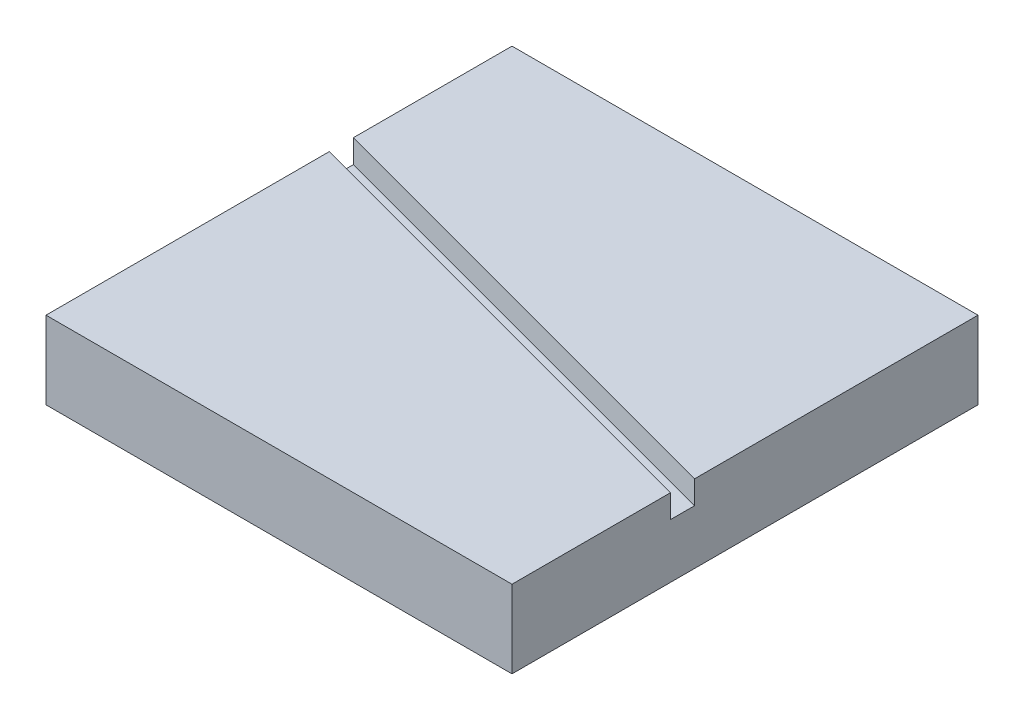
ISO-10303-21;
HEADER;
FILE_DESCRIPTION(('STEP AP214'),'2;1');
FILE_NAME('part.step','',(''),(''),'','','');
FILE_SCHEMA(('AUTOMOTIVE_DESIGN { 1 0 10303 214 1 1 1 1 }'));
ENDSEC;
DATA;
#1=APPLICATION_CONTEXT('core data for automotive mechanical design processes');
#2=APPLICATION_PROTOCOL_DEFINITION('international standard','automotive_design',2000,#1);
#3=PRODUCT_CONTEXT('',#1,'mechanical');
#4=PRODUCT('Part','Part','',(#3));
#5=PRODUCT_RELATED_PRODUCT_CATEGORY('part','',(#4));
#6=PRODUCT_DEFINITION_FORMATION('','',#4);
#7=PRODUCT_DEFINITION_CONTEXT('part definition',#1,'design');
#8=PRODUCT_DEFINITION('design','',#6,#7);
#9=PRODUCT_DEFINITION_SHAPE('','',#8);
#10=(LENGTH_UNIT() NAMED_UNIT(*) SI_UNIT(.MILLI.,.METRE.));
#11=(NAMED_UNIT(*) PLANE_ANGLE_UNIT() SI_UNIT($,.RADIAN.));
#12=(NAMED_UNIT(*) SI_UNIT($,.STERADIAN.) SOLID_ANGLE_UNIT());
#13=UNCERTAINTY_MEASURE_WITH_UNIT(LENGTH_MEASURE(1.E-05),#10,'distance_accuracy_value','');
#14=(GEOMETRIC_REPRESENTATION_CONTEXT(3) GLOBAL_UNCERTAINTY_ASSIGNED_CONTEXT((#13)) GLOBAL_UNIT_ASSIGNED_CONTEXT((#10,
#11,#12)) REPRESENTATION_CONTEXT('',''));
#15=CARTESIAN_POINT('',(0.,0.,0.));
#16=DIRECTION('',(0.,0.,1.));
#17=DIRECTION('',(1.,0.,0.));
#18=AXIS2_PLACEMENT_3D('',#15,#16,#17);
#19=CARTESIAN_POINT('',(0.,10.,0.));
#20=DIRECTION('',(0.,1.,0.));
#21=DIRECTION('',(0.,0.,1.));
#22=AXIS2_PLACEMENT_3D('',#19,#20,#21);
#23=PLANE('',#22);
#24=DIRECTION('',(-0.965925826289069,0.,-0.25881904510252));
#25=VECTOR('',#24,1.);
#26=CARTESIAN_POINT('',(0.388228567653783,10.,-1.44888873943361));
#27=LINE('',#26,#25);
#28=CARTESIAN_POINT('',(30.,10.,6.48556150231853));
#29=VERTEX_POINT('',#28);
#30=CARTESIAN_POINT('',(-30.,10.,-9.5913900435488));
#31=VERTEX_POINT('',#30);
#32=EDGE_CURVE('E41',#29,#31,#27,.T.);
#33=ORIENTED_EDGE('',*,*,#32,.F.);
#34=DIRECTION('',(0.,0.,-1.));
#35=VECTOR('',#34,1.);
#36=CARTESIAN_POINT('',(30.,10.,-30.));
#37=LINE('',#36,#35);
#38=CARTESIAN_POINT('',(30.,10.,-30.));
#39=VERTEX_POINT('',#38);
#40=EDGE_CURVE('E86',#29,#39,#37,.T.);
#41=ORIENTED_EDGE('',*,*,#40,.T.);
#42=DIRECTION('',(-1.,0.,0.));
#43=VECTOR('',#42,1.);
#44=CARTESIAN_POINT('',(-30.,10.,-30.));
#45=LINE('',#44,#43);
#46=CARTESIAN_POINT('',(-30.,10.,-30.));
#47=VERTEX_POINT('',#46);
#48=EDGE_CURVE('E124',#39,#47,#45,.T.);
#49=ORIENTED_EDGE('',*,*,#48,.T.);
#50=DIRECTION('',(0.,0.,1.));
#51=VECTOR('',#50,1.);
#52=CARTESIAN_POINT('',(-30.,10.,-30.));
#53=LINE('',#52,#51);
#54=EDGE_CURVE('E131',#47,#31,#53,.T.);
#55=ORIENTED_EDGE('',*,*,#54,.T.);
#56=EDGE_LOOP('',(#33,#41,#49,#55));
#57=FACE_BOUND('',#56,.T.);
#58=ADVANCED_FACE('F33',(#57),#23,.T.);
#59=CARTESIAN_POINT('',(30.,10.,-30.));
#60=DIRECTION('',(-1.,0.,0.));
#61=DIRECTION('',(0.,0.,1.));
#62=AXIS2_PLACEMENT_3D('',#59,#60,#61);
#63=PLANE('',#62);
#64=ORIENTED_EDGE('',*,*,#40,.F.);
#65=DIRECTION('',(0.,-1.,0.));
#66=VECTOR('',#65,1.);
#67=CARTESIAN_POINT('',(30.,10.,6.48556150231852));
#68=LINE('',#67,#66);
#69=CARTESIAN_POINT('',(30.,7.,6.48556150231853));
#70=VERTEX_POINT('',#69);
#71=EDGE_CURVE('E156',#29,#70,#68,.T.);
#72=ORIENTED_EDGE('',*,*,#71,.T.);
#73=DIRECTION('',(0.,0.,1.));
#74=VECTOR('',#73,1.);
#75=CARTESIAN_POINT('',(30.,7.,-30.));
#76=LINE('',#75,#74);
#77=CARTESIAN_POINT('',(30.,7.,9.5913900435488));
#78=VERTEX_POINT('',#77);
#79=EDGE_CURVE('E120',#70,#78,#76,.T.);
#80=ORIENTED_EDGE('',*,*,#79,.T.);
#81=DIRECTION('',(0.,1.,0.));
#82=VECTOR('',#81,1.);
#83=CARTESIAN_POINT('',(30.,10.,9.5913900435488));
#84=LINE('',#83,#82);
#85=CARTESIAN_POINT('',(30.,10.,9.5913900435488));
#86=VERTEX_POINT('',#85);
#87=EDGE_CURVE('E110',#78,#86,#84,.T.);
#88=ORIENTED_EDGE('',*,*,#87,.T.);
#89=CARTESIAN_POINT('',(30.,10.,30.));
#90=VERTEX_POINT('',#89);
#91=EDGE_CURVE('E118',#90,#86,#37,.T.);
#92=ORIENTED_EDGE('',*,*,#91,.F.);
#93=DIRECTION('',(0.,-1.,0.));
#94=VECTOR('',#93,1.);
#95=CARTESIAN_POINT('',(30.,10.,30.));
#96=LINE('',#95,#94);
#97=CARTESIAN_POINT('',(30.,0.,30.));
#98=VERTEX_POINT('',#97);
#99=EDGE_CURVE('E135',#90,#98,#96,.T.);
#100=ORIENTED_EDGE('',*,*,#99,.T.);
#101=DIRECTION('',(0.,0.,-1.));
#102=VECTOR('',#101,1.);
#103=CARTESIAN_POINT('',(30.,0.,-30.));
#104=LINE('',#103,#102);
#105=CARTESIAN_POINT('',(30.,0.,-30.));
#106=VERTEX_POINT('',#105);
#107=EDGE_CURVE('E136',#98,#106,#104,.T.);
#108=ORIENTED_EDGE('',*,*,#107,.T.);
#109=DIRECTION('',(0.,-1.,0.));
#110=VECTOR('',#109,1.);
#111=CARTESIAN_POINT('',(30.,10.,-30.));
#112=LINE('',#111,#110);
#113=EDGE_CURVE('E113',#39,#106,#112,.T.);
#114=ORIENTED_EDGE('',*,*,#113,.F.);
#115=EDGE_LOOP('',(#64,#72,#80,#88,#92,#100,#108,#114));
#116=FACE_BOUND('',#115,.T.);
#117=ADVANCED_FACE('F35',(#116),#63,.F.);
#118=CARTESIAN_POINT('',(-30.,10.,-30.));
#119=DIRECTION('',(0.,0.,1.));
#120=DIRECTION('',(1.,0.,0.));
#121=AXIS2_PLACEMENT_3D('',#118,#119,#120);
#122=PLANE('',#121);
#123=DIRECTION('',(-1.,0.,0.));
#124=VECTOR('',#123,1.);
#125=CARTESIAN_POINT('',(-30.,0.,-30.));
#126=LINE('',#125,#124);
#127=CARTESIAN_POINT('',(-30.,0.,-30.));
#128=VERTEX_POINT('',#127);
#129=EDGE_CURVE('E139',#106,#128,#126,.T.);
#130=ORIENTED_EDGE('',*,*,#129,.T.);
#131=DIRECTION('',(0.,-1.,0.));
#132=VECTOR('',#131,1.);
#133=CARTESIAN_POINT('',(-30.,10.,-30.));
#134=LINE('',#133,#132);
#135=EDGE_CURVE('E147',#47,#128,#134,.T.);
#136=ORIENTED_EDGE('',*,*,#135,.F.);
#137=ORIENTED_EDGE('',*,*,#48,.F.);
#138=ORIENTED_EDGE('',*,*,#113,.T.);
#139=EDGE_LOOP('',(#130,#136,#137,#138));
#140=FACE_BOUND('',#139,.T.);
#141=ADVANCED_FACE('F164',(#140),#122,.F.);
#142=CARTESIAN_POINT('',(-30.,10.,-30.));
#143=DIRECTION('',(1.,0.,0.));
#144=DIRECTION('',(0.,0.,-1.));
#145=AXIS2_PLACEMENT_3D('',#142,#143,#144);
#146=PLANE('',#145);
#147=DIRECTION('',(0.,0.,-1.));
#148=VECTOR('',#147,1.);
#149=CARTESIAN_POINT('',(-30.,7.,-30.));
#150=LINE('',#149,#148);
#151=CARTESIAN_POINT('',(-30.,7.,-6.48556150231859));
#152=VERTEX_POINT('',#151);
#153=CARTESIAN_POINT('',(-30.,7.,-9.5913900435488));
#154=VERTEX_POINT('',#153);
#155=EDGE_CURVE('E11',#152,#154,#150,.T.);
#156=ORIENTED_EDGE('',*,*,#155,.T.);
#157=DIRECTION('',(0.,1.,0.));
#158=VECTOR('',#157,1.);
#159=CARTESIAN_POINT('',(-30.,10.,-9.5913900435488));
#160=LINE('',#159,#158);
#161=EDGE_CURVE('E121',#154,#31,#160,.T.);
#162=ORIENTED_EDGE('',*,*,#161,.T.);
#163=ORIENTED_EDGE('',*,*,#54,.F.);
#164=ORIENTED_EDGE('',*,*,#135,.T.);
#165=DIRECTION('',(0.,0.,1.));
#166=VECTOR('',#165,1.);
#167=CARTESIAN_POINT('',(-30.,0.,-30.));
#168=LINE('',#167,#166);
#169=CARTESIAN_POINT('',(-30.,0.,30.));
#170=VERTEX_POINT('',#169);
#171=EDGE_CURVE('E141',#128,#170,#168,.T.);
#172=ORIENTED_EDGE('',*,*,#171,.T.);
#173=DIRECTION('',(0.,-1.,0.));
#174=VECTOR('',#173,1.);
#175=CARTESIAN_POINT('',(-30.,10.,30.));
#176=LINE('',#175,#174);
#177=CARTESIAN_POINT('',(-30.,10.,30.));
#178=VERTEX_POINT('',#177);
#179=EDGE_CURVE('E145',#178,#170,#176,.T.);
#180=ORIENTED_EDGE('',*,*,#179,.F.);
#181=CARTESIAN_POINT('',(-30.,10.,-6.48556150231859));
#182=VERTEX_POINT('',#181);
#183=EDGE_CURVE('E126',#182,#178,#53,.T.);
#184=ORIENTED_EDGE('',*,*,#183,.F.);
#185=DIRECTION('',(0.,-1.,0.));
#186=VECTOR('',#185,1.);
#187=CARTESIAN_POINT('',(-30.,10.,-6.48556150231859));
#188=LINE('',#187,#186);
#189=EDGE_CURVE('E48',#182,#152,#188,.T.);
#190=ORIENTED_EDGE('',*,*,#189,.T.);
#191=EDGE_LOOP('',(#156,#162,#163,#164,#172,#180,#184,#190));
#192=FACE_BOUND('',#191,.T.);
#193=ADVANCED_FACE('F159',(#192),#146,.F.);
#194=CARTESIAN_POINT('',(-30.,10.,30.));
#195=DIRECTION('',(0.,0.,-1.));
#196=DIRECTION('',(-1.,0.,0.));
#197=AXIS2_PLACEMENT_3D('',#194,#195,#196);
#198=PLANE('',#197);
#199=DIRECTION('',(1.,0.,0.));
#200=VECTOR('',#199,1.);
#201=CARTESIAN_POINT('',(-30.,0.,30.));
#202=LINE('',#201,#200);
#203=EDGE_CURVE('E78',#170,#98,#202,.T.);
#204=ORIENTED_EDGE('',*,*,#203,.T.);
#205=ORIENTED_EDGE('',*,*,#99,.F.);
#206=DIRECTION('',(1.,0.,0.));
#207=VECTOR('',#206,1.);
#208=CARTESIAN_POINT('',(-30.,10.,30.));
#209=LINE('',#208,#207);
#210=EDGE_CURVE('E57',#178,#90,#209,.T.);
#211=ORIENTED_EDGE('',*,*,#210,.F.);
#212=ORIENTED_EDGE('',*,*,#179,.T.);
#213=EDGE_LOOP('',(#204,#205,#211,#212));
#214=FACE_BOUND('',#213,.T.);
#215=ADVANCED_FACE('F170',(#214),#198,.F.);
#216=DIRECTION('',(0.965925826289068,0.,0.258819045102521));
#217=VECTOR('',#216,1.);
#218=CARTESIAN_POINT('',(-0.388228567653776,10.,1.44888873943358));
#219=LINE('',#218,#217);
#220=EDGE_CURVE('E107',#182,#86,#219,.T.);
#221=ORIENTED_EDGE('',*,*,#220,.F.);
#222=ORIENTED_EDGE('',*,*,#183,.T.);
#223=ORIENTED_EDGE('',*,*,#210,.T.);
#224=ORIENTED_EDGE('',*,*,#91,.T.);
#225=EDGE_LOOP('',(#221,#222,#223,#224));
#226=FACE_BOUND('',#225,.T.);
#227=ADVANCED_FACE('F123',(#226),#23,.T.);
#228=CARTESIAN_POINT('',(0.,0.,0.));
#229=DIRECTION('',(0.,1.,0.));
#230=DIRECTION('',(0.,0.,1.));
#231=AXIS2_PLACEMENT_3D('',#228,#229,#230);
#232=PLANE('',#231);
#233=ORIENTED_EDGE('',*,*,#107,.F.);
#234=ORIENTED_EDGE('',*,*,#203,.F.);
#235=ORIENTED_EDGE('',*,*,#171,.F.);
#236=ORIENTED_EDGE('',*,*,#129,.F.);
#237=EDGE_LOOP('',(#233,#234,#235,#236));
#238=FACE_BOUND('',#237,.T.);
#239=ADVANCED_FACE('F169',(#238),#232,.F.);
#240=CARTESIAN_POINT('',(0.,7.,0.));
#241=DIRECTION('',(0.,-1.,0.));
#242=DIRECTION('',(0.,0.,-1.));
#243=AXIS2_PLACEMENT_3D('',#240,#241,#242);
#244=PLANE('',#243);
#245=DIRECTION('',(-0.965925826289068,0.,-0.25881904510252));
#246=VECTOR('',#245,1.);
#247=CARTESIAN_POINT('',(-34.2058748779047,7.,-10.7183508205497));
#248=LINE('',#247,#246);
#249=EDGE_CURVE('E171',#70,#154,#248,.T.);
#250=ORIENTED_EDGE('',*,*,#249,.T.);
#251=ORIENTED_EDGE('',*,*,#155,.F.);
#252=DIRECTION('',(0.965925826289068,0.,0.258819045102521));
#253=VECTOR('',#252,1.);
#254=CARTESIAN_POINT('',(-34.9823320132123,7.,-7.82057334168255));
#255=LINE('',#254,#253);
#256=EDGE_CURVE('E173',#152,#78,#255,.T.);
#257=ORIENTED_EDGE('',*,*,#256,.T.);
#258=ORIENTED_EDGE('',*,*,#79,.F.);
#259=EDGE_LOOP('',(#250,#251,#257,#258));
#260=FACE_BOUND('',#259,.T.);
#261=ADVANCED_FACE('F177',(#260),#244,.F.);
#262=CARTESIAN_POINT('',(-34.2058748779047,7.,-10.7183508205497));
#263=DIRECTION('',(0.25881904510252,0.,-0.965925826289068));
#264=DIRECTION('',(-0.965925826289069,0.,-0.25881904510252));
#265=AXIS2_PLACEMENT_3D('',#262,#263,#264);
#266=PLANE('',#265);
#267=ORIENTED_EDGE('',*,*,#32,.T.);
#268=ORIENTED_EDGE('',*,*,#161,.F.);
#269=ORIENTED_EDGE('',*,*,#249,.F.);
#270=ORIENTED_EDGE('',*,*,#71,.F.);
#271=EDGE_LOOP('',(#267,#268,#269,#270));
#272=FACE_BOUND('',#271,.T.);
#273=ADVANCED_FACE('F153',(#272),#266,.F.);
#274=CARTESIAN_POINT('',(-34.9823320132123,7.,-7.82057334168255));
#275=DIRECTION('',(-0.258819045102521,0.,0.965925826289068));
#276=DIRECTION('',(0.965925826289068,0.,0.258819045102521));
#277=AXIS2_PLACEMENT_3D('',#274,#275,#276);
#278=PLANE('',#277);
#279=ORIENTED_EDGE('',*,*,#256,.F.);
#280=ORIENTED_EDGE('',*,*,#189,.F.);
#281=ORIENTED_EDGE('',*,*,#220,.T.);
#282=ORIENTED_EDGE('',*,*,#87,.F.);
#283=EDGE_LOOP('',(#279,#280,#281,#282));
#284=FACE_BOUND('',#283,.T.);
#285=ADVANCED_FACE('F109',(#284),#278,.F.);
#286=CLOSED_SHELL('',(#58,#117,#141,#193,#215,#227,#239,#261,#273,#285));
#287=MANIFOLD_SOLID_BREP('B2',#286);
#288=ADVANCED_BREP_SHAPE_REPRESENTATION('',(#18,#287),#14);
#289=SHAPE_DEFINITION_REPRESENTATION(#9,#288);
ENDSEC;
END-ISO-10303-21;
